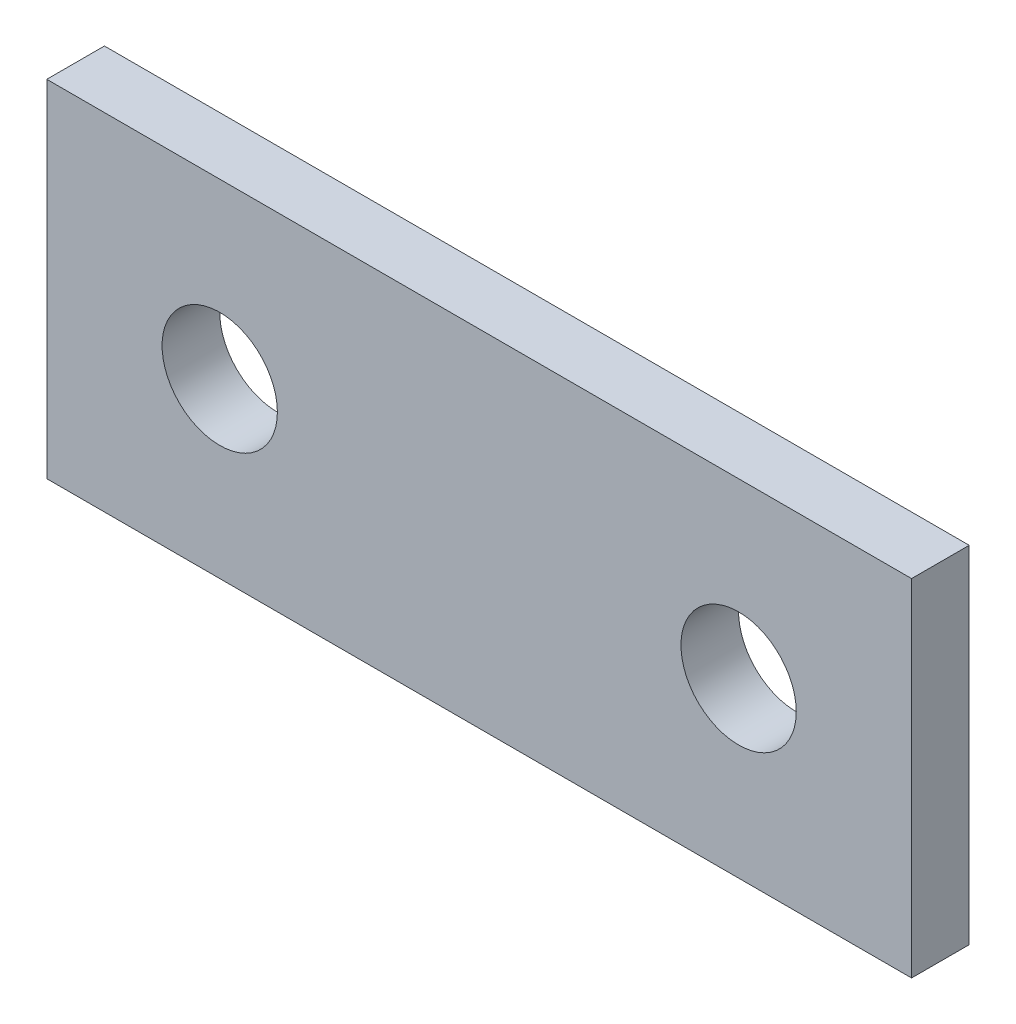
ISO-10303-21;
HEADER;
FILE_DESCRIPTION(('STEP AP214'),'2;1');
FILE_NAME('part.step','',(''),(''),'','','');
FILE_SCHEMA(('AUTOMOTIVE_DESIGN { 1 0 10303 214 1 1 1 1 }'));
ENDSEC;
DATA;
#1=APPLICATION_CONTEXT('core data for automotive mechanical design processes');
#2=APPLICATION_PROTOCOL_DEFINITION('international standard','automotive_design',2000,#1);
#3=PRODUCT_CONTEXT('',#1,'mechanical');
#4=PRODUCT('Part','Part','',(#3));
#5=PRODUCT_RELATED_PRODUCT_CATEGORY('part','',(#4));
#6=PRODUCT_DEFINITION_FORMATION('','',#4);
#7=PRODUCT_DEFINITION_CONTEXT('part definition',#1,'design');
#8=PRODUCT_DEFINITION('design','',#6,#7);
#9=PRODUCT_DEFINITION_SHAPE('','',#8);
#10=(LENGTH_UNIT() NAMED_UNIT(*) SI_UNIT(.MILLI.,.METRE.));
#11=(NAMED_UNIT(*) PLANE_ANGLE_UNIT() SI_UNIT($,.RADIAN.));
#12=(NAMED_UNIT(*) SI_UNIT($,.STERADIAN.) SOLID_ANGLE_UNIT());
#13=UNCERTAINTY_MEASURE_WITH_UNIT(LENGTH_MEASURE(1.E-05),#10,'distance_accuracy_value','');
#14=(GEOMETRIC_REPRESENTATION_CONTEXT(3) GLOBAL_UNCERTAINTY_ASSIGNED_CONTEXT((#13)) GLOBAL_UNIT_ASSIGNED_CONTEXT((#10,
#11,#12)) REPRESENTATION_CONTEXT('',''));
#15=CARTESIAN_POINT('',(0.,0.,0.));
#16=DIRECTION('',(0.,0.,1.));
#17=DIRECTION('',(1.,0.,0.));
#18=AXIS2_PLACEMENT_3D('',#15,#16,#17);
#19=CARTESIAN_POINT('',(0.,0.,1.));
#20=DIRECTION('',(0.,0.,-1.));
#21=DIRECTION('',(-1.,0.,0.));
#22=AXIS2_PLACEMENT_3D('',#19,#20,#21);
#23=PLANE('',#22);
#24=DIRECTION('',(0.,1.,0.));
#25=VECTOR('',#24,1.);
#26=CARTESIAN_POINT('',(7.5,-3.,1.));
#27=LINE('',#26,#25);
#28=CARTESIAN_POINT('',(7.5,-3.,1.));
#29=VERTEX_POINT('',#28);
#30=CARTESIAN_POINT('',(7.5,3.,1.));
#31=VERTEX_POINT('',#30);
#32=EDGE_CURVE('E86',#29,#31,#27,.T.);
#33=ORIENTED_EDGE('',*,*,#32,.T.);
#34=DIRECTION('',(-1.,0.,0.));
#35=VECTOR('',#34,1.);
#36=CARTESIAN_POINT('',(-7.5,3.,1.));
#37=LINE('',#36,#35);
#38=CARTESIAN_POINT('',(-7.5,3.,1.));
#39=VERTEX_POINT('',#38);
#40=EDGE_CURVE('E81',#31,#39,#37,.T.);
#41=ORIENTED_EDGE('',*,*,#40,.T.);
#42=DIRECTION('',(0.,-1.,0.));
#43=VECTOR('',#42,1.);
#44=CARTESIAN_POINT('',(-7.5,-3.,1.));
#45=LINE('',#44,#43);
#46=CARTESIAN_POINT('',(-7.5,-3.,1.));
#47=VERTEX_POINT('',#46);
#48=EDGE_CURVE('E84',#39,#47,#45,.T.);
#49=ORIENTED_EDGE('',*,*,#48,.T.);
#50=DIRECTION('',(1.,0.,0.));
#51=VECTOR('',#50,1.);
#52=CARTESIAN_POINT('',(-7.5,-3.,1.));
#53=LINE('',#52,#51);
#54=EDGE_CURVE('E51',#47,#29,#53,.T.);
#55=ORIENTED_EDGE('',*,*,#54,.T.);
#56=EDGE_LOOP('',(#33,#41,#49,#55));
#57=FACE_BOUND('',#56,.T.);
#58=CARTESIAN_POINT('',(4.5,0.,1.));
#59=DIRECTION('',(0.,0.,1.));
#60=DIRECTION('',(1.,0.,0.));
#61=AXIS2_PLACEMENT_3D('',#58,#59,#60);
#62=CIRCLE('',#61,1.);
#63=CARTESIAN_POINT('',(5.5,0.,1.));
#64=VERTEX_POINT('',#63);
#65=EDGE_CURVE('E101',#64,#64,#62,.T.);
#66=ORIENTED_EDGE('',*,*,#65,.F.);
#67=EDGE_LOOP('',(#66));
#68=FACE_BOUND('',#67,.T.);
#69=CARTESIAN_POINT('',(-4.5,0.,1.));
#70=DIRECTION('',(0.,0.,1.));
#71=DIRECTION('',(1.,0.,0.));
#72=AXIS2_PLACEMENT_3D('',#69,#70,#71);
#73=CIRCLE('',#72,1.);
#74=CARTESIAN_POINT('',(-3.5,0.,1.));
#75=VERTEX_POINT('',#74);
#76=EDGE_CURVE('E116',#75,#75,#73,.T.);
#77=ORIENTED_EDGE('',*,*,#76,.F.);
#78=EDGE_LOOP('',(#77));
#79=FACE_BOUND('',#78,.T.);
#80=ADVANCED_FACE('F34',(#57,#68,#79),#23,.F.);
#81=CARTESIAN_POINT('',(0.,0.,0.));
#82=DIRECTION('',(0.,0.,-1.));
#83=DIRECTION('',(-1.,0.,0.));
#84=AXIS2_PLACEMENT_3D('',#81,#82,#83);
#85=PLANE('',#84);
#86=CARTESIAN_POINT('',(4.5,0.,0.));
#87=DIRECTION('',(0.,0.,1.));
#88=DIRECTION('',(1.,0.,0.));
#89=AXIS2_PLACEMENT_3D('',#86,#87,#88);
#90=CIRCLE('',#89,1.);
#91=CARTESIAN_POINT('',(5.5,0.,0.));
#92=VERTEX_POINT('',#91);
#93=EDGE_CURVE('E113',#92,#92,#90,.T.);
#94=ORIENTED_EDGE('',*,*,#93,.T.);
#95=EDGE_LOOP('',(#94));
#96=FACE_BOUND('',#95,.T.);
#97=DIRECTION('',(0.,1.,0.));
#98=VECTOR('',#97,1.);
#99=CARTESIAN_POINT('',(7.5,-3.,0.));
#100=LINE('',#99,#98);
#101=CARTESIAN_POINT('',(7.5,-3.,0.));
#102=VERTEX_POINT('',#101);
#103=CARTESIAN_POINT('',(7.5,3.,0.));
#104=VERTEX_POINT('',#103);
#105=EDGE_CURVE('E98',#102,#104,#100,.T.);
#106=ORIENTED_EDGE('',*,*,#105,.F.);
#107=DIRECTION('',(1.,0.,0.));
#108=VECTOR('',#107,1.);
#109=CARTESIAN_POINT('',(-7.5,-3.,0.));
#110=LINE('',#109,#108);
#111=CARTESIAN_POINT('',(-7.5,-3.,0.));
#112=VERTEX_POINT('',#111);
#113=EDGE_CURVE('E74',#112,#102,#110,.T.);
#114=ORIENTED_EDGE('',*,*,#113,.F.);
#115=DIRECTION('',(0.,-1.,0.));
#116=VECTOR('',#115,1.);
#117=CARTESIAN_POINT('',(-7.5,-3.,0.));
#118=LINE('',#117,#116);
#119=CARTESIAN_POINT('',(-7.5,3.,0.));
#120=VERTEX_POINT('',#119);
#121=EDGE_CURVE('E68',#120,#112,#118,.T.);
#122=ORIENTED_EDGE('',*,*,#121,.F.);
#123=DIRECTION('',(-1.,0.,0.));
#124=VECTOR('',#123,1.);
#125=CARTESIAN_POINT('',(-7.5,3.,0.));
#126=LINE('',#125,#124);
#127=EDGE_CURVE('E90',#104,#120,#126,.T.);
#128=ORIENTED_EDGE('',*,*,#127,.F.);
#129=EDGE_LOOP('',(#106,#114,#122,#128));
#130=FACE_BOUND('',#129,.T.);
#131=CARTESIAN_POINT('',(-4.5,0.,0.));
#132=DIRECTION('',(0.,0.,1.));
#133=DIRECTION('',(1.,0.,0.));
#134=AXIS2_PLACEMENT_3D('',#131,#132,#133);
#135=CIRCLE('',#134,1.);
#136=CARTESIAN_POINT('',(-3.5,0.,0.));
#137=VERTEX_POINT('',#136);
#138=EDGE_CURVE('E119',#137,#137,#135,.T.);
#139=ORIENTED_EDGE('',*,*,#138,.T.);
#140=EDGE_LOOP('',(#139));
#141=FACE_BOUND('',#140,.T.);
#142=ADVANCED_FACE('F109',(#96,#130,#141),#85,.T.);
#143=CARTESIAN_POINT('',(7.5,-3.,1.));
#144=DIRECTION('',(-1.,0.,0.));
#145=DIRECTION('',(0.,0.,1.));
#146=AXIS2_PLACEMENT_3D('',#143,#144,#145);
#147=PLANE('',#146);
#148=ORIENTED_EDGE('',*,*,#105,.T.);
#149=DIRECTION('',(0.,0.,-1.));
#150=VECTOR('',#149,1.);
#151=CARTESIAN_POINT('',(7.5,3.,1.));
#152=LINE('',#151,#150);
#153=EDGE_CURVE('E11',#31,#104,#152,.T.);
#154=ORIENTED_EDGE('',*,*,#153,.F.);
#155=ORIENTED_EDGE('',*,*,#32,.F.);
#156=DIRECTION('',(0.,0.,-1.));
#157=VECTOR('',#156,1.);
#158=CARTESIAN_POINT('',(7.5,-3.,1.));
#159=LINE('',#158,#157);
#160=EDGE_CURVE('E94',#29,#102,#159,.T.);
#161=ORIENTED_EDGE('',*,*,#160,.T.);
#162=EDGE_LOOP('',(#148,#154,#155,#161));
#163=FACE_BOUND('',#162,.T.);
#164=ADVANCED_FACE('F36',(#163),#147,.F.);
#165=CARTESIAN_POINT('',(-7.5,3.,1.));
#166=DIRECTION('',(0.,-1.,0.));
#167=DIRECTION('',(0.,0.,-1.));
#168=AXIS2_PLACEMENT_3D('',#165,#166,#167);
#169=PLANE('',#168);
#170=ORIENTED_EDGE('',*,*,#127,.T.);
#171=DIRECTION('',(0.,0.,-1.));
#172=VECTOR('',#171,1.);
#173=CARTESIAN_POINT('',(-7.5,3.,1.));
#174=LINE('',#173,#172);
#175=EDGE_CURVE('E43',#39,#120,#174,.T.);
#176=ORIENTED_EDGE('',*,*,#175,.F.);
#177=ORIENTED_EDGE('',*,*,#40,.F.);
#178=ORIENTED_EDGE('',*,*,#153,.T.);
#179=EDGE_LOOP('',(#170,#176,#177,#178));
#180=FACE_BOUND('',#179,.T.);
#181=ADVANCED_FACE('F89',(#180),#169,.F.);
#182=CARTESIAN_POINT('',(-7.5,-3.,1.));
#183=DIRECTION('',(1.,0.,0.));
#184=DIRECTION('',(0.,0.,-1.));
#185=AXIS2_PLACEMENT_3D('',#182,#183,#184);
#186=PLANE('',#185);
#187=ORIENTED_EDGE('',*,*,#121,.T.);
#188=DIRECTION('',(0.,0.,-1.));
#189=VECTOR('',#188,1.);
#190=CARTESIAN_POINT('',(-7.5,-3.,1.));
#191=LINE('',#190,#189);
#192=EDGE_CURVE('E91',#47,#112,#191,.T.);
#193=ORIENTED_EDGE('',*,*,#192,.F.);
#194=ORIENTED_EDGE('',*,*,#48,.F.);
#195=ORIENTED_EDGE('',*,*,#175,.T.);
#196=EDGE_LOOP('',(#187,#193,#194,#195));
#197=FACE_BOUND('',#196,.T.);
#198=ADVANCED_FACE('F92',(#197),#186,.F.);
#199=CARTESIAN_POINT('',(-7.5,-3.,1.));
#200=DIRECTION('',(0.,1.,0.));
#201=DIRECTION('',(0.,0.,1.));
#202=AXIS2_PLACEMENT_3D('',#199,#200,#201);
#203=PLANE('',#202);
#204=ORIENTED_EDGE('',*,*,#113,.T.);
#205=ORIENTED_EDGE('',*,*,#160,.F.);
#206=ORIENTED_EDGE('',*,*,#54,.F.);
#207=ORIENTED_EDGE('',*,*,#192,.T.);
#208=EDGE_LOOP('',(#204,#205,#206,#207));
#209=FACE_BOUND('',#208,.T.);
#210=ADVANCED_FACE('F106',(#209),#203,.F.);
#211=CARTESIAN_POINT('',(4.5,0.,1.));
#212=DIRECTION('',(0.,0.,-1.));
#213=DIRECTION('',(-1.,0.,0.));
#214=AXIS2_PLACEMENT_3D('',#211,#212,#213);
#215=CYLINDRICAL_SURFACE('',#214,1.);
#216=ORIENTED_EDGE('',*,*,#65,.T.);
#217=EDGE_LOOP('',(#216));
#218=FACE_BOUND('',#217,.T.);
#219=ORIENTED_EDGE('',*,*,#93,.F.);
#220=EDGE_LOOP('',(#219));
#221=FACE_BOUND('',#220,.T.);
#222=ADVANCED_FACE('F136',(#218,#221),#215,.F.);
#223=CARTESIAN_POINT('',(-4.5,0.,1.));
#224=DIRECTION('',(0.,0.,-1.));
#225=DIRECTION('',(-1.,0.,0.));
#226=AXIS2_PLACEMENT_3D('',#223,#224,#225);
#227=CYLINDRICAL_SURFACE('',#226,1.);
#228=ORIENTED_EDGE('',*,*,#76,.T.);
#229=EDGE_LOOP('',(#228));
#230=FACE_BOUND('',#229,.T.);
#231=ORIENTED_EDGE('',*,*,#138,.F.);
#232=EDGE_LOOP('',(#231));
#233=FACE_BOUND('',#232,.T.);
#234=ADVANCED_FACE('F125',(#230,#233),#227,.F.);
#235=CLOSED_SHELL('',(#80,#142,#164,#181,#198,#210,#222,#234));
#236=MANIFOLD_SOLID_BREP('B2',#235);
#237=ADVANCED_BREP_SHAPE_REPRESENTATION('',(#18,#236),#14);
#238=SHAPE_DEFINITION_REPRESENTATION(#9,#237);
ENDSEC;
END-ISO-10303-21;
